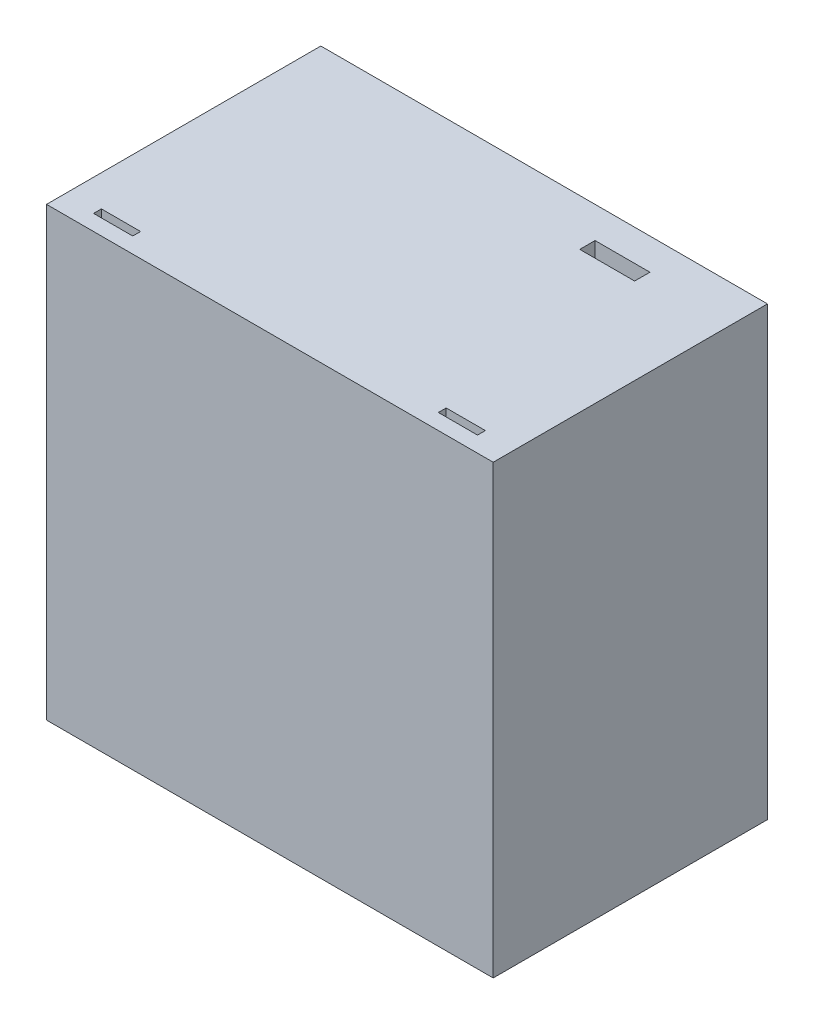
ISO-10303-21;
HEADER;
FILE_DESCRIPTION(('STEP AP214'),'2;1');
FILE_NAME('part.step','',(''),(''),'','','');
FILE_SCHEMA(('AUTOMOTIVE_DESIGN { 1 0 10303 214 1 1 1 1 }'));
ENDSEC;
DATA;
#1=APPLICATION_CONTEXT('core data for automotive mechanical design processes');
#2=APPLICATION_PROTOCOL_DEFINITION('international standard','automotive_design',2000,#1);
#3=PRODUCT_CONTEXT('',#1,'mechanical');
#4=PRODUCT('Part','Part','',(#3));
#5=PRODUCT_RELATED_PRODUCT_CATEGORY('part','',(#4));
#6=PRODUCT_DEFINITION_FORMATION('','',#4);
#7=PRODUCT_DEFINITION_CONTEXT('part definition',#1,'design');
#8=PRODUCT_DEFINITION('design','',#6,#7);
#9=PRODUCT_DEFINITION_SHAPE('','',#8);
#10=(LENGTH_UNIT() NAMED_UNIT(*) SI_UNIT(.MILLI.,.METRE.));
#11=(NAMED_UNIT(*) PLANE_ANGLE_UNIT() SI_UNIT($,.RADIAN.));
#12=(NAMED_UNIT(*) SI_UNIT($,.STERADIAN.) SOLID_ANGLE_UNIT());
#13=UNCERTAINTY_MEASURE_WITH_UNIT(LENGTH_MEASURE(1.E-05),#10,'distance_accuracy_value','');
#14=(GEOMETRIC_REPRESENTATION_CONTEXT(3) GLOBAL_UNCERTAINTY_ASSIGNED_CONTEXT((#13)) GLOBAL_UNIT_ASSIGNED_CONTEXT((#10,
#11,#12)) REPRESENTATION_CONTEXT('',''));
#15=CARTESIAN_POINT('',(0.,0.,0.));
#16=DIRECTION('',(0.,0.,1.));
#17=DIRECTION('',(1.,0.,0.));
#18=AXIS2_PLACEMENT_3D('',#15,#16,#17);
#19=CARTESIAN_POINT('',(0.,0.,0.));
#20=DIRECTION('',(0.,0.,1.));
#21=DIRECTION('',(1.,0.,0.));
#22=AXIS2_PLACEMENT_3D('',#19,#20,#21);
#23=PLANE('',#22);
#24=DIRECTION('',(0.,1.,0.));
#25=VECTOR('',#24,1.);
#26=CARTESIAN_POINT('',(-30.4830097087379,24.0121359223301,0.));
#27=LINE('',#26,#25);
#28=CARTESIAN_POINT('',(-30.4830097087379,7.7621359223301,0.));
#29=VERTEX_POINT('',#28);
#30=CARTESIAN_POINT('',(-30.4830097087379,24.0121359223301,0.));
#31=VERTEX_POINT('',#30);
#32=EDGE_CURVE('E358',#29,#31,#27,.T.);
#33=ORIENTED_EDGE('',*,*,#32,.F.);
#34=DIRECTION('',(1.,0.,0.));
#35=VECTOR('',#34,1.);
#36=CARTESIAN_POINT('',(-40.4830097087378,7.7621359223301,0.));
#37=LINE('',#36,#35);
#38=CARTESIAN_POINT('',(-34.2330097087379,7.7621359223301,0.));
#39=VERTEX_POINT('',#38);
#40=EDGE_CURVE('E275',#39,#29,#37,.T.);
#41=ORIENTED_EDGE('',*,*,#40,.F.);
#42=DIRECTION('',(0.,-1.,0.));
#43=VECTOR('',#42,1.);
#44=CARTESIAN_POINT('',(-34.2330097087379,27.7621359223301,0.));
#45=LINE('',#44,#43);
#46=CARTESIAN_POINT('',(-34.2330097087379,27.7621359223301,0.));
#47=VERTEX_POINT('',#46);
#48=EDGE_CURVE('E484',#47,#39,#45,.T.);
#49=ORIENTED_EDGE('',*,*,#48,.F.);
#50=DIRECTION('',(-1.,0.,0.));
#51=VECTOR('',#50,1.);
#52=CARTESIAN_POINT('',(-34.2330097087379,27.7621359223301,0.));
#53=LINE('',#52,#51);
#54=CARTESIAN_POINT('',(22.7669902912621,27.7621359223301,0.));
#55=VERTEX_POINT('',#54);
#56=EDGE_CURVE('E474',#55,#47,#53,.T.);
#57=ORIENTED_EDGE('',*,*,#56,.F.);
#58=DIRECTION('',(0.,1.,0.));
#59=VECTOR('',#58,1.);
#60=CARTESIAN_POINT('',(22.7669902912621,27.7621359223301,0.));
#61=LINE('',#60,#59);
#62=CARTESIAN_POINT('',(22.7669902912621,-29.2378640776699,0.));
#63=VERTEX_POINT('',#62);
#64=EDGE_CURVE('E493',#63,#55,#61,.T.);
#65=ORIENTED_EDGE('',*,*,#64,.F.);
#66=DIRECTION('',(1.,0.,0.));
#67=VECTOR('',#66,1.);
#68=CARTESIAN_POINT('',(-34.2330097087379,-29.2378640776699,0.));
#69=LINE('',#68,#67);
#70=CARTESIAN_POINT('',(2.76699029126214,-29.2378640776699,0.));
#71=VERTEX_POINT('',#70);
#72=EDGE_CURVE('E488',#71,#63,#69,.T.);
#73=ORIENTED_EDGE('',*,*,#72,.F.);
#74=DIRECTION('',(0.,1.,0.));
#75=VECTOR('',#74,1.);
#76=CARTESIAN_POINT('',(2.76699029126214,-30.4878640776699,0.));
#77=LINE('',#76,#75);
#78=CARTESIAN_POINT('',(2.76699029126214,-25.4878640776699,0.));
#79=VERTEX_POINT('',#78);
#80=EDGE_CURVE('E314',#71,#79,#77,.T.);
#81=ORIENTED_EDGE('',*,*,#80,.T.);
#82=DIRECTION('',(-1.,0.,0.));
#83=VECTOR('',#82,1.);
#84=CARTESIAN_POINT('',(19.0169902912621,-25.4878640776699,0.));
#85=LINE('',#84,#83);
#86=CARTESIAN_POINT('',(19.0169902912621,-25.4878640776699,0.));
#87=VERTEX_POINT('',#86);
#88=EDGE_CURVE('E354',#87,#79,#85,.T.);
#89=ORIENTED_EDGE('',*,*,#88,.F.);
#90=DIRECTION('',(0.,-1.,0.));
#91=VECTOR('',#90,1.);
#92=CARTESIAN_POINT('',(19.0169902912621,24.0121359223301,0.));
#93=LINE('',#92,#91);
#94=CARTESIAN_POINT('',(19.0169902912621,24.0121359223301,0.));
#95=VERTEX_POINT('',#94);
#96=EDGE_CURVE('E332',#95,#87,#93,.T.);
#97=ORIENTED_EDGE('',*,*,#96,.F.);
#98=DIRECTION('',(1.,0.,0.));
#99=VECTOR('',#98,1.);
#100=CARTESIAN_POINT('',(19.0169902912621,24.0121359223301,0.));
#101=LINE('',#100,#99);
#102=EDGE_CURVE('E338',#31,#95,#101,.T.);
#103=ORIENTED_EDGE('',*,*,#102,.F.);
#104=EDGE_LOOP('',(#33,#41,#49,#57,#65,#73,#81,#89,#97,#103));
#105=FACE_BOUND('',#104,.T.);
#106=ADVANCED_FACE('F39',(#105),#23,.F.);
#107=CARTESIAN_POINT('',(-34.2330097087379,27.7621359223301,35.));
#108=DIRECTION('',(1.,0.,0.));
#109=DIRECTION('',(0.,0.,-1.));
#110=AXIS2_PLACEMENT_3D('',#107,#108,#109);
#111=PLANE('',#110);
#112=ORIENTED_EDGE('',*,*,#48,.T.);
#113=DIRECTION('',(0.,0.,1.));
#114=VECTOR('',#113,1.);
#115=CARTESIAN_POINT('',(-34.2330097087379,7.76213592233009,35.));
#116=LINE('',#115,#114);
#117=CARTESIAN_POINT('',(-34.2330097087379,7.7621359223301,12.));
#118=VERTEX_POINT('',#117);
#119=EDGE_CURVE('E288',#39,#118,#116,.T.);
#120=ORIENTED_EDGE('',*,*,#119,.T.);
#121=CARTESIAN_POINT('',(-34.2330097087379,-0.737864077669904,12.));
#122=DIRECTION('',(1.,0.,0.));
#123=DIRECTION('',(0.,0.,-1.));
#124=AXIS2_PLACEMENT_3D('',#121,#122,#123);
#125=CIRCLE('',#124,8.5);
#126=CARTESIAN_POINT('',(-34.2330097087379,-9.23786407766991,12.));
#127=VERTEX_POINT('',#126);
#128=EDGE_CURVE('E292',#118,#127,#125,.T.);
#129=ORIENTED_EDGE('',*,*,#128,.T.);
#130=DIRECTION('',(0.,0.,-1.));
#131=VECTOR('',#130,1.);
#132=CARTESIAN_POINT('',(-34.2330097087379,-9.23786407766991,35.));
#133=LINE('',#132,#131);
#134=CARTESIAN_POINT('',(-34.2330097087379,-9.23786407766991,0.));
#135=VERTEX_POINT('',#134);
#136=EDGE_CURVE('E274',#127,#135,#133,.T.);
#137=ORIENTED_EDGE('',*,*,#136,.T.);
#138=CARTESIAN_POINT('',(-34.2330097087379,-29.2378640776699,0.));
#139=VERTEX_POINT('',#138);
#140=EDGE_CURVE('E468',#135,#139,#45,.T.);
#141=ORIENTED_EDGE('',*,*,#140,.T.);
#142=DIRECTION('',(0.,0.,-1.));
#143=VECTOR('',#142,1.);
#144=CARTESIAN_POINT('',(-34.2330097087379,-29.2378640776699,35.));
#145=LINE('',#144,#143);
#146=CARTESIAN_POINT('',(-34.2330097087379,-29.2378640776699,35.));
#147=VERTEX_POINT('',#146);
#148=EDGE_CURVE('E509',#147,#139,#145,.T.);
#149=ORIENTED_EDGE('',*,*,#148,.F.);
#150=DIRECTION('',(0.,-1.,0.));
#151=VECTOR('',#150,1.);
#152=CARTESIAN_POINT('',(-34.2330097087379,27.7621359223301,35.));
#153=LINE('',#152,#151);
#154=CARTESIAN_POINT('',(-34.2330097087379,27.7621359223301,35.));
#155=VERTEX_POINT('',#154);
#156=EDGE_CURVE('E469',#155,#147,#153,.T.);
#157=ORIENTED_EDGE('',*,*,#156,.F.);
#158=DIRECTION('',(0.,0.,-1.));
#159=VECTOR('',#158,1.);
#160=CARTESIAN_POINT('',(-34.2330097087379,27.7621359223301,35.));
#161=LINE('',#160,#159);
#162=EDGE_CURVE('E483',#155,#47,#161,.T.);
#163=ORIENTED_EDGE('',*,*,#162,.T.);
#164=EDGE_LOOP('',(#112,#120,#129,#137,#141,#149,#157,#163));
#165=FACE_BOUND('',#164,.T.);
#166=ADVANCED_FACE('F41',(#165),#111,.F.);
#167=CARTESIAN_POINT('',(-34.2330097087379,-29.2378640776699,35.));
#168=DIRECTION('',(0.,1.,0.));
#169=DIRECTION('',(0.,0.,1.));
#170=AXIS2_PLACEMENT_3D('',#167,#168,#169);
#171=PLANE('',#170);
#172=DIRECTION('',(-1.,0.,0.));
#173=VECTOR('',#172,1.);
#174=CARTESIAN_POINT('',(-34.2330097087379,-29.2378640776699,32.));
#175=LINE('',#174,#173);
#176=CARTESIAN_POINT('',(-25.2330097087379,-29.2378640776699,32.));
#177=VERTEX_POINT('',#176);
#178=CARTESIAN_POINT('',(-30.2330097087379,-29.2378640776699,32.));
#179=VERTEX_POINT('',#178);
#180=EDGE_CURVE('E460',#177,#179,#175,.T.);
#181=ORIENTED_EDGE('',*,*,#180,.T.);
#182=DIRECTION('',(0.,0.,1.));
#183=VECTOR('',#182,1.);
#184=CARTESIAN_POINT('',(-30.2330097087379,-29.2378640776699,35.));
#185=LINE('',#184,#183);
#186=CARTESIAN_POINT('',(-30.2330097087379,-29.2378640776699,33.));
#187=VERTEX_POINT('',#186);
#188=EDGE_CURVE('E464',#179,#187,#185,.T.);
#189=ORIENTED_EDGE('',*,*,#188,.T.);
#190=DIRECTION('',(1.,0.,0.));
#191=VECTOR('',#190,1.);
#192=CARTESIAN_POINT('',(-34.2330097087379,-29.2378640776699,33.));
#193=LINE('',#192,#191);
#194=CARTESIAN_POINT('',(-25.2330097087379,-29.2378640776699,33.));
#195=VERTEX_POINT('',#194);
#196=EDGE_CURVE('E452',#187,#195,#193,.T.);
#197=ORIENTED_EDGE('',*,*,#196,.T.);
#198=DIRECTION('',(0.,0.,-1.));
#199=VECTOR('',#198,1.);
#200=CARTESIAN_POINT('',(-25.2330097087379,-29.2378640776699,35.));
#201=LINE('',#200,#199);
#202=EDGE_CURVE('E456',#195,#177,#201,.T.);
#203=ORIENTED_EDGE('',*,*,#202,.T.);
#204=EDGE_LOOP('',(#181,#189,#197,#203));
#205=FACE_BOUND('',#204,.T.);
#206=DIRECTION('',(-1.,0.,0.));
#207=VECTOR('',#206,1.);
#208=CARTESIAN_POINT('',(-34.2330097087379,-29.2378640776699,32.));
#209=LINE('',#208,#207);
#210=CARTESIAN_POINT('',(18.7669902912621,-29.2378640776699,32.));
#211=VERTEX_POINT('',#210);
#212=CARTESIAN_POINT('',(13.7669902912621,-29.2378640776699,32.));
#213=VERTEX_POINT('',#212);
#214=EDGE_CURVE('E444',#211,#213,#209,.T.);
#215=ORIENTED_EDGE('',*,*,#214,.T.);
#216=DIRECTION('',(0.,0.,1.));
#217=VECTOR('',#216,1.);
#218=CARTESIAN_POINT('',(13.7669902912621,-29.2378640776699,35.));
#219=LINE('',#218,#217);
#220=CARTESIAN_POINT('',(13.7669902912621,-29.2378640776699,33.));
#221=VERTEX_POINT('',#220);
#222=EDGE_CURVE('E448',#213,#221,#219,.T.);
#223=ORIENTED_EDGE('',*,*,#222,.T.);
#224=DIRECTION('',(1.,0.,0.));
#225=VECTOR('',#224,1.);
#226=CARTESIAN_POINT('',(-34.2330097087379,-29.2378640776699,33.));
#227=LINE('',#226,#225);
#228=CARTESIAN_POINT('',(18.7669902912621,-29.2378640776699,33.));
#229=VERTEX_POINT('',#228);
#230=EDGE_CURVE('E401',#221,#229,#227,.T.);
#231=ORIENTED_EDGE('',*,*,#230,.T.);
#232=DIRECTION('',(0.,0.,-1.));
#233=VECTOR('',#232,1.);
#234=CARTESIAN_POINT('',(18.7669902912621,-29.2378640776699,35.));
#235=LINE('',#234,#233);
#236=EDGE_CURVE('E440',#229,#211,#235,.T.);
#237=ORIENTED_EDGE('',*,*,#236,.T.);
#238=EDGE_LOOP('',(#215,#223,#231,#237));
#239=FACE_BOUND('',#238,.T.);
#240=CARTESIAN_POINT('',(-14.2330097087379,-29.2378640776699,0.));
#241=VERTEX_POINT('',#240);
#242=EDGE_CURVE('E489',#139,#241,#69,.T.);
#243=ORIENTED_EDGE('',*,*,#242,.T.);
#244=DIRECTION('',(0.,0.,1.));
#245=VECTOR('',#244,1.);
#246=CARTESIAN_POINT('',(-14.2330097087379,-29.2378640776699,35.));
#247=LINE('',#246,#245);
#248=CARTESIAN_POINT('',(-14.2330097087379,-29.2378640776699,12.));
#249=VERTEX_POINT('',#248);
#250=EDGE_CURVE('E324',#241,#249,#247,.T.);
#251=ORIENTED_EDGE('',*,*,#250,.T.);
#252=CARTESIAN_POINT('',(-5.73300970873786,-29.2378640776699,12.));
#253=DIRECTION('',(0.,1.,0.));
#254=DIRECTION('',(0.,0.,1.));
#255=AXIS2_PLACEMENT_3D('',#252,#253,#254);
#256=CIRCLE('',#255,8.5);
#257=CARTESIAN_POINT('',(2.76699029126214,-29.2378640776699,12.));
#258=VERTEX_POINT('',#257);
#259=EDGE_CURVE('E328',#249,#258,#256,.T.);
#260=ORIENTED_EDGE('',*,*,#259,.T.);
#261=DIRECTION('',(0.,0.,-1.));
#262=VECTOR('',#261,1.);
#263=CARTESIAN_POINT('',(2.76699029126214,-29.2378640776699,35.));
#264=LINE('',#263,#262);
#265=EDGE_CURVE('E310',#258,#71,#264,.T.);
#266=ORIENTED_EDGE('',*,*,#265,.T.);
#267=ORIENTED_EDGE('',*,*,#72,.T.);
#268=DIRECTION('',(0.,0.,-1.));
#269=VECTOR('',#268,1.);
#270=CARTESIAN_POINT('',(22.7669902912621,-29.2378640776699,35.));
#271=LINE('',#270,#269);
#272=CARTESIAN_POINT('',(22.7669902912621,-29.2378640776699,35.));
#273=VERTEX_POINT('',#272);
#274=EDGE_CURVE('E505',#273,#63,#271,.T.);
#275=ORIENTED_EDGE('',*,*,#274,.F.);
#276=DIRECTION('',(1.,0.,0.));
#277=VECTOR('',#276,1.);
#278=CARTESIAN_POINT('',(-34.2330097087379,-29.2378640776699,35.));
#279=LINE('',#278,#277);
#280=EDGE_CURVE('E473',#147,#273,#279,.T.);
#281=ORIENTED_EDGE('',*,*,#280,.F.);
#282=ORIENTED_EDGE('',*,*,#148,.T.);
#283=EDGE_LOOP('',(#243,#251,#260,#266,#267,#275,#281,#282));
#284=FACE_BOUND('',#283,.T.);
#285=ADVANCED_FACE('F546',(#205,#239,#284),#171,.F.);
#286=CARTESIAN_POINT('',(22.7669902912621,27.7621359223301,35.));
#287=DIRECTION('',(-1.,0.,0.));
#288=DIRECTION('',(0.,-1.,0.));
#289=AXIS2_PLACEMENT_3D('',#286,#287,#288);
#290=PLANE('',#289);
#291=ORIENTED_EDGE('',*,*,#64,.T.);
#292=DIRECTION('',(0.,0.,-1.));
#293=VECTOR('',#292,1.);
#294=CARTESIAN_POINT('',(22.7669902912621,27.7621359223301,35.));
#295=LINE('',#294,#293);
#296=CARTESIAN_POINT('',(22.7669902912621,27.7621359223301,35.));
#297=VERTEX_POINT('',#296);
#298=EDGE_CURVE('E501',#297,#55,#295,.T.);
#299=ORIENTED_EDGE('',*,*,#298,.F.);
#300=DIRECTION('',(0.,1.,0.));
#301=VECTOR('',#300,1.);
#302=CARTESIAN_POINT('',(22.7669902912621,27.7621359223301,35.));
#303=LINE('',#302,#301);
#304=EDGE_CURVE('E477',#273,#297,#303,.T.);
#305=ORIENTED_EDGE('',*,*,#304,.F.);
#306=ORIENTED_EDGE('',*,*,#274,.T.);
#307=EDGE_LOOP('',(#291,#299,#305,#306));
#308=FACE_BOUND('',#307,.T.);
#309=ADVANCED_FACE('F668',(#308),#290,.F.);
#310=CARTESIAN_POINT('',(-34.2330097087379,27.7621359223301,35.));
#311=DIRECTION('',(0.,-1.,0.));
#312=DIRECTION('',(0.,0.,-1.));
#313=AXIS2_PLACEMENT_3D('',#310,#311,#312);
#314=PLANE('',#313);
#315=DIRECTION('',(1.,0.,0.));
#316=VECTOR('',#315,1.);
#317=CARTESIAN_POINT('',(4.76699029126214,27.7621359223301,5.95256684431433));
#318=LINE('',#317,#316);
#319=CARTESIAN_POINT('',(4.76699029126214,27.7621359223301,5.95256684431433));
#320=VERTEX_POINT('',#319);
#321=CARTESIAN_POINT('',(11.7669902912621,27.7621359223301,5.95256684431433));
#322=VERTEX_POINT('',#321);
#323=EDGE_CURVE('E238',#320,#322,#318,.T.);
#324=ORIENTED_EDGE('',*,*,#323,.F.);
#325=DIRECTION('',(0.,0.,1.));
#326=VECTOR('',#325,1.);
#327=CARTESIAN_POINT('',(4.7669902912621,27.7621359223301,4.));
#328=LINE('',#327,#326);
#329=CARTESIAN_POINT('',(4.7669902912621,27.7621359223301,4.));
#330=VERTEX_POINT('',#329);
#331=EDGE_CURVE('E55',#330,#320,#328,.T.);
#332=ORIENTED_EDGE('',*,*,#331,.F.);
#333=DIRECTION('',(-1.,0.,0.));
#334=VECTOR('',#333,1.);
#335=CARTESIAN_POINT('',(4.7669902912621,27.7621359223301,4.));
#336=LINE('',#335,#334);
#337=CARTESIAN_POINT('',(11.7669902912621,27.7621359223301,4.));
#338=VERTEX_POINT('',#337);
#339=EDGE_CURVE('E246',#338,#330,#336,.T.);
#340=ORIENTED_EDGE('',*,*,#339,.F.);
#341=DIRECTION('',(0.,0.,-1.));
#342=VECTOR('',#341,1.);
#343=CARTESIAN_POINT('',(11.7669902912621,27.7621359223301,4.));
#344=LINE('',#343,#342);
#345=EDGE_CURVE('E228',#322,#338,#344,.T.);
#346=ORIENTED_EDGE('',*,*,#345,.F.);
#347=EDGE_LOOP('',(#324,#332,#340,#346));
#348=FACE_BOUND('',#347,.T.);
#349=DIRECTION('',(1.,0.,0.));
#350=VECTOR('',#349,1.);
#351=CARTESIAN_POINT('',(-30.2330097087379,27.7621359223301,33.));
#352=LINE('',#351,#350);
#353=CARTESIAN_POINT('',(-30.2330097087379,27.7621359223301,33.));
#354=VERTEX_POINT('',#353);
#355=CARTESIAN_POINT('',(-25.2330097087379,27.7621359223301,33.));
#356=VERTEX_POINT('',#355);
#357=EDGE_CURVE('E384',#354,#356,#352,.T.);
#358=ORIENTED_EDGE('',*,*,#357,.F.);
#359=DIRECTION('',(0.,0.,1.));
#360=VECTOR('',#359,1.);
#361=CARTESIAN_POINT('',(-30.2330097087379,27.7621359223301,32.));
#362=LINE('',#361,#360);
#363=CARTESIAN_POINT('',(-30.2330097087379,27.7621359223301,32.));
#364=VERTEX_POINT('',#363);
#365=EDGE_CURVE('E381',#364,#354,#362,.T.);
#366=ORIENTED_EDGE('',*,*,#365,.F.);
#367=DIRECTION('',(-1.,0.,0.));
#368=VECTOR('',#367,1.);
#369=CARTESIAN_POINT('',(-30.2330097087379,27.7621359223301,32.));
#370=LINE('',#369,#368);
#371=CARTESIAN_POINT('',(-25.2330097087379,27.7621359223301,32.));
#372=VERTEX_POINT('',#371);
#373=EDGE_CURVE('E393',#372,#364,#370,.T.);
#374=ORIENTED_EDGE('',*,*,#373,.F.);
#375=DIRECTION('',(0.,0.,-1.));
#376=VECTOR('',#375,1.);
#377=CARTESIAN_POINT('',(-25.2330097087379,27.7621359223301,32.));
#378=LINE('',#377,#376);
#379=EDGE_CURVE('E389',#356,#372,#378,.T.);
#380=ORIENTED_EDGE('',*,*,#379,.F.);
#381=EDGE_LOOP('',(#358,#366,#374,#380));
#382=FACE_BOUND('',#381,.T.);
#383=DIRECTION('',(1.,0.,0.));
#384=VECTOR('',#383,1.);
#385=CARTESIAN_POINT('',(13.7669902912621,27.7621359223301,33.));
#386=LINE('',#385,#384);
#387=CARTESIAN_POINT('',(13.7669902912621,27.7621359223301,33.));
#388=VERTEX_POINT('',#387);
#389=CARTESIAN_POINT('',(18.7669902912621,27.7621359223301,33.));
#390=VERTEX_POINT('',#389);
#391=EDGE_CURVE('E413',#388,#390,#386,.T.);
#392=ORIENTED_EDGE('',*,*,#391,.F.);
#393=DIRECTION('',(0.,0.,1.));
#394=VECTOR('',#393,1.);
#395=CARTESIAN_POINT('',(13.7669902912621,27.7621359223301,32.));
#396=LINE('',#395,#394);
#397=CARTESIAN_POINT('',(13.7669902912621,27.7621359223301,32.));
#398=VERTEX_POINT('',#397);
#399=EDGE_CURVE('E369',#398,#388,#396,.T.);
#400=ORIENTED_EDGE('',*,*,#399,.F.);
#401=DIRECTION('',(-1.,0.,0.));
#402=VECTOR('',#401,1.);
#403=CARTESIAN_POINT('',(13.7669902912621,27.7621359223301,32.));
#404=LINE('',#403,#402);
#405=CARTESIAN_POINT('',(18.7669902912621,27.7621359223301,32.));
#406=VERTEX_POINT('',#405);
#407=EDGE_CURVE('E421',#406,#398,#404,.T.);
#408=ORIENTED_EDGE('',*,*,#407,.F.);
#409=DIRECTION('',(0.,0.,-1.));
#410=VECTOR('',#409,1.);
#411=CARTESIAN_POINT('',(18.7669902912621,27.7621359223301,32.));
#412=LINE('',#411,#410);
#413=EDGE_CURVE('E417',#390,#406,#412,.T.);
#414=ORIENTED_EDGE('',*,*,#413,.F.);
#415=EDGE_LOOP('',(#392,#400,#408,#414));
#416=FACE_BOUND('',#415,.T.);
#417=ORIENTED_EDGE('',*,*,#56,.T.);
#418=ORIENTED_EDGE('',*,*,#162,.F.);
#419=DIRECTION('',(-1.,0.,0.));
#420=VECTOR('',#419,1.);
#421=CARTESIAN_POINT('',(-34.2330097087379,27.7621359223301,35.));
#422=LINE('',#421,#420);
#423=EDGE_CURVE('E480',#297,#155,#422,.T.);
#424=ORIENTED_EDGE('',*,*,#423,.F.);
#425=ORIENTED_EDGE('',*,*,#298,.T.);
#426=EDGE_LOOP('',(#417,#418,#424,#425));
#427=FACE_BOUND('',#426,.T.);
#428=ADVANCED_FACE('F243',(#348,#382,#416,#427),#314,.F.);
#429=CARTESIAN_POINT('',(0.,0.,35.));
#430=DIRECTION('',(0.,0.,1.));
#431=DIRECTION('',(1.,0.,0.));
#432=AXIS2_PLACEMENT_3D('',#429,#430,#431);
#433=PLANE('',#432);
#434=ORIENTED_EDGE('',*,*,#156,.T.);
#435=ORIENTED_EDGE('',*,*,#280,.T.);
#436=ORIENTED_EDGE('',*,*,#304,.T.);
#437=ORIENTED_EDGE('',*,*,#423,.T.);
#438=EDGE_LOOP('',(#434,#435,#436,#437));
#439=FACE_BOUND('',#438,.T.);
#440=ADVANCED_FACE('F553',(#439),#433,.T.);
#441=ORIENTED_EDGE('',*,*,#140,.F.);
#442=DIRECTION('',(1.,0.,0.));
#443=VECTOR('',#442,1.);
#444=CARTESIAN_POINT('',(-40.4830097087378,-9.23786407766991,0.));
#445=LINE('',#444,#443);
#446=CARTESIAN_POINT('',(-30.4830097087379,-9.23786407766991,0.));
#447=VERTEX_POINT('',#446);
#448=EDGE_CURVE('E278',#135,#447,#445,.T.);
#449=ORIENTED_EDGE('',*,*,#448,.T.);
#450=CARTESIAN_POINT('',(-30.4830097087379,-25.4878640776699,0.));
#451=VERTEX_POINT('',#450);
#452=EDGE_CURVE('E359',#451,#447,#27,.T.);
#453=ORIENTED_EDGE('',*,*,#452,.F.);
#454=CARTESIAN_POINT('',(-14.2330097087379,-25.4878640776699,0.));
#455=VERTEX_POINT('',#454);
#456=EDGE_CURVE('E353',#455,#451,#85,.T.);
#457=ORIENTED_EDGE('',*,*,#456,.F.);
#458=DIRECTION('',(0.,1.,0.));
#459=VECTOR('',#458,1.);
#460=CARTESIAN_POINT('',(-14.2330097087379,-30.4878640776699,0.));
#461=LINE('',#460,#459);
#462=EDGE_CURVE('E311',#241,#455,#461,.T.);
#463=ORIENTED_EDGE('',*,*,#462,.F.);
#464=ORIENTED_EDGE('',*,*,#242,.F.);
#465=EDGE_LOOP('',(#441,#449,#453,#457,#463,#464));
#466=FACE_BOUND('',#465,.T.);
#467=ADVANCED_FACE('F542',(#466),#23,.F.);
#468=CARTESIAN_POINT('',(13.7669902912621,-32.2378640776699,32.));
#469=DIRECTION('',(-1.,0.,0.));
#470=DIRECTION('',(0.,0.,1.));
#471=AXIS2_PLACEMENT_3D('',#468,#469,#470);
#472=PLANE('',#471);
#473=DIRECTION('',(0.,1.,0.));
#474=VECTOR('',#473,1.);
#475=CARTESIAN_POINT('',(13.7669902912621,-32.2378640776699,32.));
#476=LINE('',#475,#474);
#477=EDGE_CURVE('E385',#213,#398,#476,.T.);
#478=ORIENTED_EDGE('',*,*,#477,.T.);
#479=ORIENTED_EDGE('',*,*,#399,.T.);
#480=DIRECTION('',(0.,1.,0.));
#481=VECTOR('',#480,1.);
#482=CARTESIAN_POINT('',(13.7669902912621,-32.2378640776699,33.));
#483=LINE('',#482,#481);
#484=EDGE_CURVE('E425',#221,#388,#483,.T.);
#485=ORIENTED_EDGE('',*,*,#484,.F.);
#486=ORIENTED_EDGE('',*,*,#222,.F.);
#487=EDGE_LOOP('',(#478,#479,#485,#486));
#488=FACE_BOUND('',#487,.T.);
#489=ADVANCED_FACE('F552',(#488),#472,.F.);
#490=CARTESIAN_POINT('',(13.7669902912621,-32.2378640776699,32.));
#491=DIRECTION('',(0.,0.,-1.));
#492=DIRECTION('',(-1.,0.,0.));
#493=AXIS2_PLACEMENT_3D('',#490,#491,#492);
#494=PLANE('',#493);
#495=DIRECTION('',(0.,1.,0.));
#496=VECTOR('',#495,1.);
#497=CARTESIAN_POINT('',(18.7669902912621,-32.2378640776699,32.));
#498=LINE('',#497,#496);
#499=EDGE_CURVE('E428',#211,#406,#498,.T.);
#500=ORIENTED_EDGE('',*,*,#499,.T.);
#501=ORIENTED_EDGE('',*,*,#407,.T.);
#502=ORIENTED_EDGE('',*,*,#477,.F.);
#503=ORIENTED_EDGE('',*,*,#214,.F.);
#504=EDGE_LOOP('',(#500,#501,#502,#503));
#505=FACE_BOUND('',#504,.T.);
#506=ADVANCED_FACE('F559',(#505),#494,.F.);
#507=CARTESIAN_POINT('',(18.7669902912621,-32.2378640776699,32.));
#508=DIRECTION('',(1.,0.,0.));
#509=DIRECTION('',(0.,0.,-1.));
#510=AXIS2_PLACEMENT_3D('',#507,#508,#509);
#511=PLANE('',#510);
#512=DIRECTION('',(0.,1.,0.));
#513=VECTOR('',#512,1.);
#514=CARTESIAN_POINT('',(18.7669902912621,-32.2378640776699,33.));
#515=LINE('',#514,#513);
#516=EDGE_CURVE('E431',#229,#390,#515,.T.);
#517=ORIENTED_EDGE('',*,*,#516,.T.);
#518=ORIENTED_EDGE('',*,*,#413,.T.);
#519=ORIENTED_EDGE('',*,*,#499,.F.);
#520=ORIENTED_EDGE('',*,*,#236,.F.);
#521=EDGE_LOOP('',(#517,#518,#519,#520));
#522=FACE_BOUND('',#521,.T.);
#523=ADVANCED_FACE('F648',(#522),#511,.F.);
#524=CARTESIAN_POINT('',(13.7669902912621,-32.2378640776699,33.));
#525=DIRECTION('',(0.,0.,1.));
#526=DIRECTION('',(1.,0.,0.));
#527=AXIS2_PLACEMENT_3D('',#524,#525,#526);
#528=PLANE('',#527);
#529=ORIENTED_EDGE('',*,*,#484,.T.);
#530=ORIENTED_EDGE('',*,*,#391,.T.);
#531=ORIENTED_EDGE('',*,*,#516,.F.);
#532=ORIENTED_EDGE('',*,*,#230,.F.);
#533=EDGE_LOOP('',(#529,#530,#531,#532));
#534=FACE_BOUND('',#533,.T.);
#535=ADVANCED_FACE('F644',(#534),#528,.F.);
#536=CARTESIAN_POINT('',(-30.2330097087379,-32.2378640776699,32.));
#537=DIRECTION('',(-1.,0.,0.));
#538=DIRECTION('',(0.,0.,1.));
#539=AXIS2_PLACEMENT_3D('',#536,#537,#538);
#540=PLANE('',#539);
#541=DIRECTION('',(0.,1.,0.));
#542=VECTOR('',#541,1.);
#543=CARTESIAN_POINT('',(-30.2330097087379,-32.2378640776699,32.));
#544=LINE('',#543,#542);
#545=EDGE_CURVE('E398',#179,#364,#544,.T.);
#546=ORIENTED_EDGE('',*,*,#545,.T.);
#547=ORIENTED_EDGE('',*,*,#365,.T.);
#548=DIRECTION('',(0.,1.,0.));
#549=VECTOR('',#548,1.);
#550=CARTESIAN_POINT('',(-30.2330097087379,-32.2378640776699,33.));
#551=LINE('',#550,#549);
#552=EDGE_CURVE('E397',#187,#354,#551,.T.);
#553=ORIENTED_EDGE('',*,*,#552,.F.);
#554=ORIENTED_EDGE('',*,*,#188,.F.);
#555=EDGE_LOOP('',(#546,#547,#553,#554));
#556=FACE_BOUND('',#555,.T.);
#557=ADVANCED_FACE('F637',(#556),#540,.F.);
#558=CARTESIAN_POINT('',(-30.2330097087379,-32.2378640776699,32.));
#559=DIRECTION('',(0.,0.,-1.));
#560=DIRECTION('',(-1.,0.,0.));
#561=AXIS2_PLACEMENT_3D('',#558,#559,#560);
#562=PLANE('',#561);
#563=DIRECTION('',(0.,1.,0.));
#564=VECTOR('',#563,1.);
#565=CARTESIAN_POINT('',(-25.2330097087379,-32.2378640776699,32.));
#566=LINE('',#565,#564);
#567=EDGE_CURVE('E402',#177,#372,#566,.T.);
#568=ORIENTED_EDGE('',*,*,#567,.T.);
#569=ORIENTED_EDGE('',*,*,#373,.T.);
#570=ORIENTED_EDGE('',*,*,#545,.F.);
#571=ORIENTED_EDGE('',*,*,#180,.F.);
#572=EDGE_LOOP('',(#568,#569,#570,#571));
#573=FACE_BOUND('',#572,.T.);
#574=ADVANCED_FACE('F634',(#573),#562,.F.);
#575=CARTESIAN_POINT('',(-25.2330097087379,-32.2378640776699,32.));
#576=DIRECTION('',(1.,0.,0.));
#577=DIRECTION('',(0.,0.,-1.));
#578=AXIS2_PLACEMENT_3D('',#575,#576,#577);
#579=PLANE('',#578);
#580=DIRECTION('',(0.,1.,0.));
#581=VECTOR('',#580,1.);
#582=CARTESIAN_POINT('',(-25.2330097087379,-32.2378640776699,33.));
#583=LINE('',#582,#581);
#584=EDGE_CURVE('E405',#195,#356,#583,.T.);
#585=ORIENTED_EDGE('',*,*,#584,.T.);
#586=ORIENTED_EDGE('',*,*,#379,.T.);
#587=ORIENTED_EDGE('',*,*,#567,.F.);
#588=ORIENTED_EDGE('',*,*,#202,.F.);
#589=EDGE_LOOP('',(#585,#586,#587,#588));
#590=FACE_BOUND('',#589,.T.);
#591=ADVANCED_FACE('F628',(#590),#579,.F.);
#592=CARTESIAN_POINT('',(-30.2330097087379,-32.2378640776699,33.));
#593=DIRECTION('',(0.,0.,1.));
#594=DIRECTION('',(1.,0.,0.));
#595=AXIS2_PLACEMENT_3D('',#592,#593,#594);
#596=PLANE('',#595);
#597=ORIENTED_EDGE('',*,*,#552,.T.);
#598=ORIENTED_EDGE('',*,*,#357,.T.);
#599=ORIENTED_EDGE('',*,*,#584,.F.);
#600=ORIENTED_EDGE('',*,*,#196,.F.);
#601=EDGE_LOOP('',(#597,#598,#599,#600));
#602=FACE_BOUND('',#601,.T.);
#603=ADVANCED_FACE('F621',(#602),#596,.F.);
#604=CARTESIAN_POINT('',(19.0169902912621,24.0121359223301,28.));
#605=DIRECTION('',(1.,0.,0.));
#606=DIRECTION('',(0.,1.,0.));
#607=AXIS2_PLACEMENT_3D('',#604,#605,#606);
#608=PLANE('',#607);
#609=ORIENTED_EDGE('',*,*,#96,.T.);
#610=DIRECTION('',(0.,0.,-1.));
#611=VECTOR('',#610,1.);
#612=CARTESIAN_POINT('',(19.0169902912621,-25.4878640776699,28.));
#613=LINE('',#612,#611);
#614=CARTESIAN_POINT('',(19.0169902912621,-25.4878640776699,28.));
#615=VERTEX_POINT('',#614);
#616=EDGE_CURVE('E350',#615,#87,#613,.T.);
#617=ORIENTED_EDGE('',*,*,#616,.F.);
#618=DIRECTION('',(0.,-1.,0.));
#619=VECTOR('',#618,1.);
#620=CARTESIAN_POINT('',(19.0169902912621,24.0121359223301,28.));
#621=LINE('',#620,#619);
#622=CARTESIAN_POINT('',(19.0169902912621,24.0121359223301,28.));
#623=VERTEX_POINT('',#622);
#624=EDGE_CURVE('E333',#623,#615,#621,.T.);
#625=ORIENTED_EDGE('',*,*,#624,.F.);
#626=DIRECTION('',(0.,0.,-1.));
#627=VECTOR('',#626,1.);
#628=CARTESIAN_POINT('',(19.0169902912621,24.0121359223301,28.));
#629=LINE('',#628,#627);
#630=EDGE_CURVE('E366',#623,#95,#629,.T.);
#631=ORIENTED_EDGE('',*,*,#630,.T.);
#632=EDGE_LOOP('',(#609,#617,#625,#631));
#633=FACE_BOUND('',#632,.T.);
#634=ADVANCED_FACE('F619',(#633),#608,.F.);
#635=CARTESIAN_POINT('',(19.0169902912621,24.0121359223301,28.));
#636=DIRECTION('',(0.,1.,0.));
#637=DIRECTION('',(0.,0.,1.));
#638=AXIS2_PLACEMENT_3D('',#635,#636,#637);
#639=PLANE('',#638);
#640=DIRECTION('',(-1.,0.,0.));
#641=VECTOR('',#640,1.);
#642=CARTESIAN_POINT('',(19.0169902912621,24.0121359223301,4.));
#643=LINE('',#642,#641);
#644=CARTESIAN_POINT('',(11.7669902912621,24.0121359223301,4.));
#645=VERTEX_POINT('',#644);
#646=CARTESIAN_POINT('',(4.7669902912621,24.0121359223301,4.));
#647=VERTEX_POINT('',#646);
#648=EDGE_CURVE('E48',#645,#647,#643,.T.);
#649=ORIENTED_EDGE('',*,*,#648,.T.);
#650=DIRECTION('',(0.,0.,1.));
#651=VECTOR('',#650,1.);
#652=CARTESIAN_POINT('',(4.76699029126256,24.0121359223301,28.0000000000003));
#653=LINE('',#652,#651);
#654=CARTESIAN_POINT('',(4.76699029126214,24.0121359223301,5.95256684431433));
#655=VERTEX_POINT('',#654);
#656=EDGE_CURVE('E11',#647,#655,#653,.T.);
#657=ORIENTED_EDGE('',*,*,#656,.T.);
#658=DIRECTION('',(1.,0.,0.));
#659=VECTOR('',#658,1.);
#660=CARTESIAN_POINT('',(19.0169902912621,24.0121359223301,5.95256684431433));
#661=LINE('',#660,#659);
#662=CARTESIAN_POINT('',(11.7669902912621,24.0121359223301,5.95256684431433));
#663=VERTEX_POINT('',#662);
#664=EDGE_CURVE('E513',#655,#663,#661,.T.);
#665=ORIENTED_EDGE('',*,*,#664,.T.);
#666=DIRECTION('',(0.,0.,-1.));
#667=VECTOR('',#666,1.);
#668=CARTESIAN_POINT('',(11.7669902912621,24.0121359223301,28.));
#669=LINE('',#668,#667);
#670=EDGE_CURVE('E231',#663,#645,#669,.T.);
#671=ORIENTED_EDGE('',*,*,#670,.T.);
#672=EDGE_LOOP('',(#649,#657,#665,#671));
#673=FACE_BOUND('',#672,.T.);
#674=ORIENTED_EDGE('',*,*,#102,.T.);
#675=ORIENTED_EDGE('',*,*,#630,.F.);
#676=DIRECTION('',(1.,0.,0.));
#677=VECTOR('',#676,1.);
#678=CARTESIAN_POINT('',(19.0169902912621,24.0121359223301,28.));
#679=LINE('',#678,#677);
#680=CARTESIAN_POINT('',(-30.4830097087379,24.0121359223301,28.));
#681=VERTEX_POINT('',#680);
#682=EDGE_CURVE('E346',#681,#623,#679,.T.);
#683=ORIENTED_EDGE('',*,*,#682,.F.);
#684=DIRECTION('',(0.,0.,-1.));
#685=VECTOR('',#684,1.);
#686=CARTESIAN_POINT('',(-30.4830097087379,24.0121359223301,28.));
#687=LINE('',#686,#685);
#688=EDGE_CURVE('E370',#681,#31,#687,.T.);
#689=ORIENTED_EDGE('',*,*,#688,.T.);
#690=EDGE_LOOP('',(#674,#675,#683,#689));
#691=FACE_BOUND('',#690,.T.);
#692=ADVANCED_FACE('F520',(#673,#691),#639,.F.);
#693=CARTESIAN_POINT('',(-30.4830097087379,24.0121359223301,28.));
#694=DIRECTION('',(-1.,0.,0.));
#695=DIRECTION('',(0.,-1.,0.));
#696=AXIS2_PLACEMENT_3D('',#693,#694,#695);
#697=PLANE('',#696);
#698=CARTESIAN_POINT('',(-30.4830097087379,-0.737864077669904,12.));
#699=DIRECTION('',(1.,0.,0.));
#700=DIRECTION('',(0.,1.,0.));
#701=AXIS2_PLACEMENT_3D('',#698,#699,#700);
#702=CIRCLE('',#701,8.5);
#703=CARTESIAN_POINT('',(-30.4830097087379,7.7621359223301,12.));
#704=VERTEX_POINT('',#703);
#705=CARTESIAN_POINT('',(-30.4830097087379,-9.2378640776699,12.));
#706=VERTEX_POINT('',#705);
#707=EDGE_CURVE('E256',#704,#706,#702,.T.);
#708=ORIENTED_EDGE('',*,*,#707,.F.);
#709=DIRECTION('',(0.,0.,1.));
#710=VECTOR('',#709,1.);
#711=CARTESIAN_POINT('',(-30.4830097087379,7.7621359223301,0.));
#712=LINE('',#711,#710);
#713=EDGE_CURVE('E266',#29,#704,#712,.T.);
#714=ORIENTED_EDGE('',*,*,#713,.F.);
#715=ORIENTED_EDGE('',*,*,#32,.T.);
#716=ORIENTED_EDGE('',*,*,#688,.F.);
#717=DIRECTION('',(0.,1.,0.));
#718=VECTOR('',#717,1.);
#719=CARTESIAN_POINT('',(-30.4830097087379,24.0121359223301,28.));
#720=LINE('',#719,#718);
#721=CARTESIAN_POINT('',(-30.4830097087379,-25.4878640776699,28.));
#722=VERTEX_POINT('',#721);
#723=EDGE_CURVE('E342',#722,#681,#720,.T.);
#724=ORIENTED_EDGE('',*,*,#723,.F.);
#725=DIRECTION('',(0.,0.,-1.));
#726=VECTOR('',#725,1.);
#727=CARTESIAN_POINT('',(-30.4830097087379,-25.4878640776699,28.));
#728=LINE('',#727,#726);
#729=EDGE_CURVE('E374',#722,#451,#728,.T.);
#730=ORIENTED_EDGE('',*,*,#729,.T.);
#731=ORIENTED_EDGE('',*,*,#452,.T.);
#732=DIRECTION('',(0.,0.,-1.));
#733=VECTOR('',#732,1.);
#734=CARTESIAN_POINT('',(-30.4830097087379,-9.23786407766991,12.));
#735=LINE('',#734,#733);
#736=EDGE_CURVE('E263',#706,#447,#735,.T.);
#737=ORIENTED_EDGE('',*,*,#736,.F.);
#738=EDGE_LOOP('',(#708,#714,#715,#716,#724,#730,#731,#737));
#739=FACE_BOUND('',#738,.T.);
#740=ADVANCED_FACE('F581',(#739),#697,.F.);
#741=CARTESIAN_POINT('',(19.0169902912621,-25.4878640776699,28.));
#742=DIRECTION('',(0.,-1.,0.));
#743=DIRECTION('',(0.,0.,-1.));
#744=AXIS2_PLACEMENT_3D('',#741,#742,#743);
#745=PLANE('',#744);
#746=CARTESIAN_POINT('',(-5.73300970873786,-25.4878640776699,12.));
#747=DIRECTION('',(0.,1.,0.));
#748=DIRECTION('',(0.,0.,1.));
#749=AXIS2_PLACEMENT_3D('',#746,#747,#748);
#750=CIRCLE('',#749,8.5);
#751=CARTESIAN_POINT('',(-14.2330097087379,-25.4878640776699,12.));
#752=VERTEX_POINT('',#751);
#753=CARTESIAN_POINT('',(2.76699029126214,-25.4878640776699,12.));
#754=VERTEX_POINT('',#753);
#755=EDGE_CURVE('E296',#752,#754,#750,.T.);
#756=ORIENTED_EDGE('',*,*,#755,.F.);
#757=DIRECTION('',(0.,0.,1.));
#758=VECTOR('',#757,1.);
#759=CARTESIAN_POINT('',(-14.2330097087379,-25.4878640776699,0.));
#760=LINE('',#759,#758);
#761=EDGE_CURVE('E302',#455,#752,#760,.T.);
#762=ORIENTED_EDGE('',*,*,#761,.F.);
#763=ORIENTED_EDGE('',*,*,#456,.T.);
#764=ORIENTED_EDGE('',*,*,#729,.F.);
#765=DIRECTION('',(-1.,0.,0.));
#766=VECTOR('',#765,1.);
#767=CARTESIAN_POINT('',(19.0169902912621,-25.4878640776699,28.));
#768=LINE('',#767,#766);
#769=EDGE_CURVE('E337',#615,#722,#768,.T.);
#770=ORIENTED_EDGE('',*,*,#769,.F.);
#771=ORIENTED_EDGE('',*,*,#616,.T.);
#772=ORIENTED_EDGE('',*,*,#88,.T.);
#773=DIRECTION('',(0.,0.,-1.));
#774=VECTOR('',#773,1.);
#775=CARTESIAN_POINT('',(2.76699029126214,-25.4878640776699,12.));
#776=LINE('',#775,#774);
#777=EDGE_CURVE('E299',#754,#79,#776,.T.);
#778=ORIENTED_EDGE('',*,*,#777,.F.);
#779=EDGE_LOOP('',(#756,#762,#763,#764,#770,#771,#772,#778));
#780=FACE_BOUND('',#779,.T.);
#781=ADVANCED_FACE('F576',(#780),#745,.F.);
#782=CARTESIAN_POINT('',(0.,0.,28.));
#783=DIRECTION('',(0.,0.,-1.));
#784=DIRECTION('',(-1.,0.,0.));
#785=AXIS2_PLACEMENT_3D('',#782,#783,#784);
#786=PLANE('',#785);
#787=ORIENTED_EDGE('',*,*,#624,.T.);
#788=ORIENTED_EDGE('',*,*,#769,.T.);
#789=ORIENTED_EDGE('',*,*,#723,.T.);
#790=ORIENTED_EDGE('',*,*,#682,.T.);
#791=EDGE_LOOP('',(#787,#788,#789,#790));
#792=FACE_BOUND('',#791,.T.);
#793=ADVANCED_FACE('F585',(#792),#786,.T.);
#794=CARTESIAN_POINT('',(-5.73300970873786,-30.4878640776699,12.));
#795=DIRECTION('',(0.,1.,0.));
#796=DIRECTION('',(0.,0.,1.));
#797=AXIS2_PLACEMENT_3D('',#794,#795,#796);
#798=CYLINDRICAL_SURFACE('',#797,8.5);
#799=DIRECTION('',(0.,1.,0.));
#800=VECTOR('',#799,1.);
#801=CARTESIAN_POINT('',(-14.2330097087379,-30.4878640776699,12.));
#802=LINE('',#801,#800);
#803=EDGE_CURVE('E307',#249,#752,#802,.T.);
#804=ORIENTED_EDGE('',*,*,#803,.T.);
#805=ORIENTED_EDGE('',*,*,#755,.T.);
#806=DIRECTION('',(0.,1.,0.));
#807=VECTOR('',#806,1.);
#808=CARTESIAN_POINT('',(2.76699029126214,-30.4878640776699,12.));
#809=LINE('',#808,#807);
#810=EDGE_CURVE('E306',#258,#754,#809,.T.);
#811=ORIENTED_EDGE('',*,*,#810,.F.);
#812=ORIENTED_EDGE('',*,*,#259,.F.);
#813=EDGE_LOOP('',(#804,#805,#811,#812));
#814=FACE_BOUND('',#813,.T.);
#815=ADVANCED_FACE('F601',(#814),#798,.F.);
#816=CARTESIAN_POINT('',(-14.2330097087379,-30.4878640776699,0.));
#817=DIRECTION('',(-1.,0.,0.));
#818=DIRECTION('',(0.,0.,1.));
#819=AXIS2_PLACEMENT_3D('',#816,#817,#818);
#820=PLANE('',#819);
#821=ORIENTED_EDGE('',*,*,#462,.T.);
#822=ORIENTED_EDGE('',*,*,#761,.T.);
#823=ORIENTED_EDGE('',*,*,#803,.F.);
#824=ORIENTED_EDGE('',*,*,#250,.F.);
#825=EDGE_LOOP('',(#821,#822,#823,#824));
#826=FACE_BOUND('',#825,.T.);
#827=ADVANCED_FACE('F603',(#826),#820,.F.);
#828=CARTESIAN_POINT('',(2.76699029126214,-30.4878640776699,12.));
#829=DIRECTION('',(1.,0.,0.));
#830=DIRECTION('',(0.,0.,-1.));
#831=AXIS2_PLACEMENT_3D('',#828,#829,#830);
#832=PLANE('',#831);
#833=ORIENTED_EDGE('',*,*,#810,.T.);
#834=ORIENTED_EDGE('',*,*,#777,.T.);
#835=ORIENTED_EDGE('',*,*,#80,.F.);
#836=ORIENTED_EDGE('',*,*,#265,.F.);
#837=EDGE_LOOP('',(#833,#834,#835,#836));
#838=FACE_BOUND('',#837,.T.);
#839=ADVANCED_FACE('F595',(#838),#832,.F.);
#840=CARTESIAN_POINT('',(-40.4830097087378,-0.737864077669903,12.));
#841=DIRECTION('',(1.,0.,0.));
#842=DIRECTION('',(0.,1.,0.));
#843=AXIS2_PLACEMENT_3D('',#840,#841,#842);
#844=CYLINDRICAL_SURFACE('',#843,8.5);
#845=DIRECTION('',(1.,0.,0.));
#846=VECTOR('',#845,1.);
#847=CARTESIAN_POINT('',(-40.4830097087378,7.7621359223301,12.));
#848=LINE('',#847,#846);
#849=EDGE_CURVE('E271',#118,#704,#848,.T.);
#850=ORIENTED_EDGE('',*,*,#849,.T.);
#851=ORIENTED_EDGE('',*,*,#707,.T.);
#852=DIRECTION('',(1.,0.,0.));
#853=VECTOR('',#852,1.);
#854=CARTESIAN_POINT('',(-40.4830097087378,-9.23786407766991,12.));
#855=LINE('',#854,#853);
#856=EDGE_CURVE('E270',#127,#706,#855,.T.);
#857=ORIENTED_EDGE('',*,*,#856,.F.);
#858=ORIENTED_EDGE('',*,*,#128,.F.);
#859=EDGE_LOOP('',(#850,#851,#857,#858));
#860=FACE_BOUND('',#859,.T.);
#861=ADVANCED_FACE('F617',(#860),#844,.F.);
#862=CARTESIAN_POINT('',(-40.4830097087378,7.7621359223301,0.));
#863=DIRECTION('',(0.,1.,0.));
#864=DIRECTION('',(0.,0.,1.));
#865=AXIS2_PLACEMENT_3D('',#862,#863,#864);
#866=PLANE('',#865);
#867=ORIENTED_EDGE('',*,*,#40,.T.);
#868=ORIENTED_EDGE('',*,*,#713,.T.);
#869=ORIENTED_EDGE('',*,*,#849,.F.);
#870=ORIENTED_EDGE('',*,*,#119,.F.);
#871=EDGE_LOOP('',(#867,#868,#869,#870));
#872=FACE_BOUND('',#871,.T.);
#873=ADVANCED_FACE('F534',(#872),#866,.F.);
#874=CARTESIAN_POINT('',(-40.4830097087378,-9.23786407766991,12.));
#875=DIRECTION('',(0.,-1.,0.));
#876=DIRECTION('',(1.,0.,0.));
#877=AXIS2_PLACEMENT_3D('',#874,#875,#876);
#878=PLANE('',#877);
#879=ORIENTED_EDGE('',*,*,#856,.T.);
#880=ORIENTED_EDGE('',*,*,#736,.T.);
#881=ORIENTED_EDGE('',*,*,#448,.F.);
#882=ORIENTED_EDGE('',*,*,#136,.F.);
#883=EDGE_LOOP('',(#879,#880,#881,#882));
#884=FACE_BOUND('',#883,.T.);
#885=ADVANCED_FACE('F527',(#884),#878,.F.);
#886=CARTESIAN_POINT('',(4.7669902912621,15.7621359223301,4.));
#887=DIRECTION('',(-1.,0.,0.));
#888=DIRECTION('',(0.,0.,1.));
#889=AXIS2_PLACEMENT_3D('',#886,#887,#888);
#890=PLANE('',#889);
#891=DIRECTION('',(0.,1.,0.));
#892=VECTOR('',#891,1.);
#893=CARTESIAN_POINT('',(4.7669902912621,15.7621359223301,4.));
#894=LINE('',#893,#892);
#895=EDGE_CURVE('E253',#647,#330,#894,.T.);
#896=ORIENTED_EDGE('',*,*,#895,.T.);
#897=ORIENTED_EDGE('',*,*,#331,.T.);
#898=DIRECTION('',(0.,1.,0.));
#899=VECTOR('',#898,1.);
#900=CARTESIAN_POINT('',(4.76699029126214,15.7621359223301,5.95256684431433));
#901=LINE('',#900,#899);
#902=EDGE_CURVE('E235',#655,#320,#901,.T.);
#903=ORIENTED_EDGE('',*,*,#902,.F.);
#904=ORIENTED_EDGE('',*,*,#656,.F.);
#905=EDGE_LOOP('',(#896,#897,#903,#904));
#906=FACE_BOUND('',#905,.T.);
#907=ADVANCED_FACE('F525',(#906),#890,.F.);
#908=CARTESIAN_POINT('',(4.7669902912621,15.7621359223301,4.));
#909=DIRECTION('',(0.,0.,-1.));
#910=DIRECTION('',(-1.,0.,0.));
#911=AXIS2_PLACEMENT_3D('',#908,#909,#910);
#912=PLANE('',#911);
#913=DIRECTION('',(0.,1.,0.));
#914=VECTOR('',#913,1.);
#915=CARTESIAN_POINT('',(11.7669902912621,15.7621359223301,4.));
#916=LINE('',#915,#914);
#917=EDGE_CURVE('E234',#645,#338,#916,.T.);
#918=ORIENTED_EDGE('',*,*,#917,.T.);
#919=ORIENTED_EDGE('',*,*,#339,.T.);
#920=ORIENTED_EDGE('',*,*,#895,.F.);
#921=ORIENTED_EDGE('',*,*,#648,.F.);
#922=EDGE_LOOP('',(#918,#919,#920,#921));
#923=FACE_BOUND('',#922,.T.);
#924=ADVANCED_FACE('F524',(#923),#912,.F.);
#925=CARTESIAN_POINT('',(11.7669902912621,15.7621359223301,4.));
#926=DIRECTION('',(1.,0.,0.));
#927=DIRECTION('',(0.,0.,-1.));
#928=AXIS2_PLACEMENT_3D('',#925,#926,#927);
#929=PLANE('',#928);
#930=DIRECTION('',(0.,1.,0.));
#931=VECTOR('',#930,1.);
#932=CARTESIAN_POINT('',(11.7669902912621,15.7621359223301,5.95256684431433));
#933=LINE('',#932,#931);
#934=EDGE_CURVE('E63',#663,#322,#933,.T.);
#935=ORIENTED_EDGE('',*,*,#934,.T.);
#936=ORIENTED_EDGE('',*,*,#345,.T.);
#937=ORIENTED_EDGE('',*,*,#917,.F.);
#938=ORIENTED_EDGE('',*,*,#670,.F.);
#939=EDGE_LOOP('',(#935,#936,#937,#938));
#940=FACE_BOUND('',#939,.T.);
#941=ADVANCED_FACE('F225',(#940),#929,.F.);
#942=CARTESIAN_POINT('',(4.76699029126214,15.7621359223301,5.95256684431433));
#943=DIRECTION('',(0.,0.,1.));
#944=DIRECTION('',(1.,0.,0.));
#945=AXIS2_PLACEMENT_3D('',#942,#943,#944);
#946=PLANE('',#945);
#947=ORIENTED_EDGE('',*,*,#902,.T.);
#948=ORIENTED_EDGE('',*,*,#323,.T.);
#949=ORIENTED_EDGE('',*,*,#934,.F.);
#950=ORIENTED_EDGE('',*,*,#664,.F.);
#951=EDGE_LOOP('',(#947,#948,#949,#950));
#952=FACE_BOUND('',#951,.T.);
#953=ADVANCED_FACE('F239',(#952),#946,.F.);
#954=CLOSED_SHELL('',(#106,#166,#285,#309,#428,#440,#467,#489,#506,#523,#535,#557,#574,#591,
#603,#634,#692,#740,#781,#793,#815,#827,#839,#861,#873,#885,#907,#924,#941,#953));
#955=MANIFOLD_SOLID_BREP('B2',#954);
#956=ADVANCED_BREP_SHAPE_REPRESENTATION('',(#18,#955),#14);
#957=SHAPE_DEFINITION_REPRESENTATION(#9,#956);
ENDSEC;
END-ISO-10303-21;
